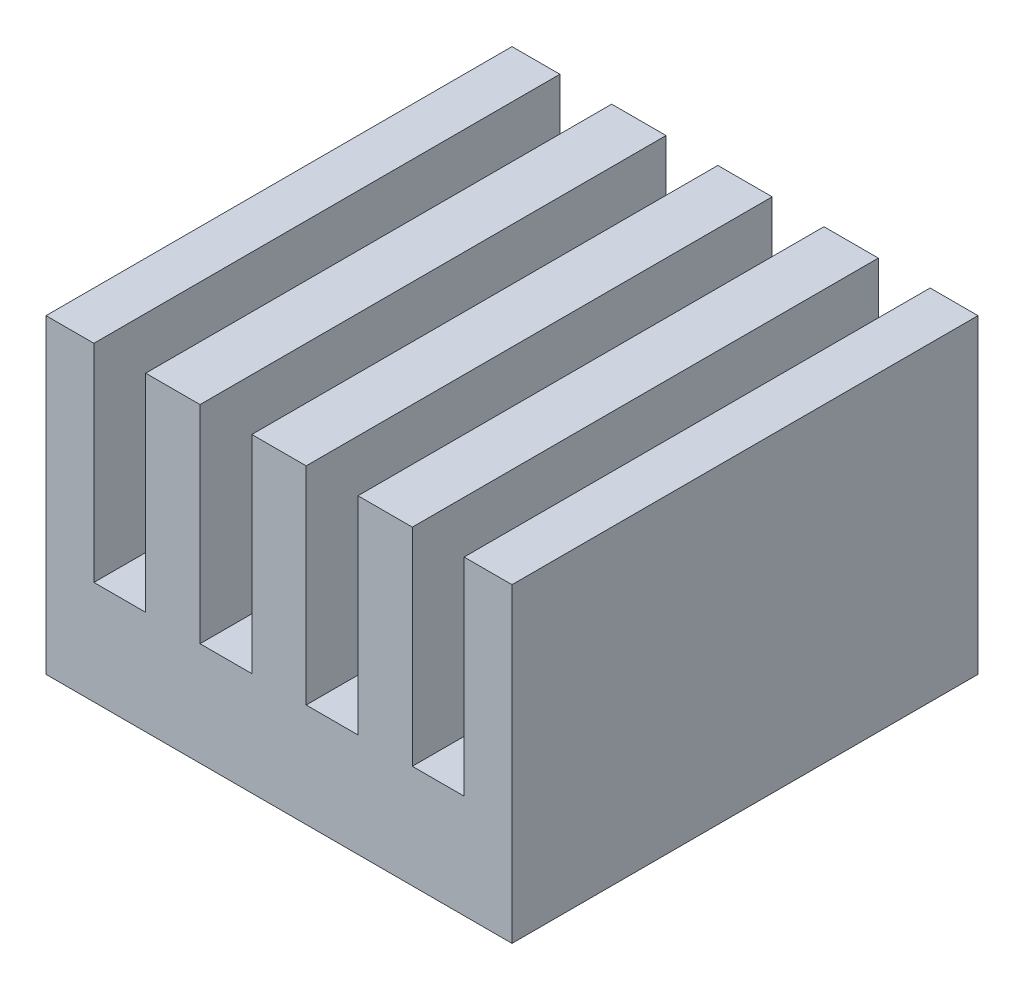
ISO-10303-21;
HEADER;
FILE_DESCRIPTION(('STEP AP214'),'2;1');
FILE_NAME('part.step','',(''),(''),'','','');
FILE_SCHEMA(('AUTOMOTIVE_DESIGN { 1 0 10303 214 1 1 1 1 }'));
ENDSEC;
DATA;
#1=APPLICATION_CONTEXT('core data for automotive mechanical design processes');
#2=APPLICATION_PROTOCOL_DEFINITION('international standard','automotive_design',2000,#1);
#3=PRODUCT_CONTEXT('',#1,'mechanical');
#4=PRODUCT('Part','Part','',(#3));
#5=PRODUCT_RELATED_PRODUCT_CATEGORY('part','',(#4));
#6=PRODUCT_DEFINITION_FORMATION('','',#4);
#7=PRODUCT_DEFINITION_CONTEXT('part definition',#1,'design');
#8=PRODUCT_DEFINITION('design','',#6,#7);
#9=PRODUCT_DEFINITION_SHAPE('','',#8);
#10=(LENGTH_UNIT() NAMED_UNIT(*) SI_UNIT(.MILLI.,.METRE.));
#11=(NAMED_UNIT(*) PLANE_ANGLE_UNIT() SI_UNIT($,.RADIAN.));
#12=(NAMED_UNIT(*) SI_UNIT($,.STERADIAN.) SOLID_ANGLE_UNIT());
#13=UNCERTAINTY_MEASURE_WITH_UNIT(LENGTH_MEASURE(1.E-05),#10,'distance_accuracy_value','');
#14=(GEOMETRIC_REPRESENTATION_CONTEXT(3) GLOBAL_UNCERTAINTY_ASSIGNED_CONTEXT((#13)) GLOBAL_UNIT_ASSIGNED_CONTEXT((#10,
#11,#12)) REPRESENTATION_CONTEXT('',''));
#15=CARTESIAN_POINT('',(0.,0.,0.));
#16=DIRECTION('',(0.,0.,1.));
#17=DIRECTION('',(1.,0.,0.));
#18=AXIS2_PLACEMENT_3D('',#15,#16,#17);
#19=CARTESIAN_POINT('',(-3.575,0.,9.));
#20=DIRECTION('',(1.,0.,0.));
#21=DIRECTION('',(0.,0.,-1.));
#22=AXIS2_PLACEMENT_3D('',#19,#20,#21);
#23=PLANE('',#22);
#24=DIRECTION('',(0.,-1.,0.));
#25=VECTOR('',#24,1.);
#26=CARTESIAN_POINT('',(-3.575,0.,0.));
#27=LINE('',#26,#25);
#28=CARTESIAN_POINT('',(-3.575,6.,0.));
#29=VERTEX_POINT('',#28);
#30=CARTESIAN_POINT('',(-3.575,2.,0.));
#31=VERTEX_POINT('',#30);
#32=EDGE_CURVE('E227',#29,#31,#27,.T.);
#33=ORIENTED_EDGE('',*,*,#32,.F.);
#34=DIRECTION('',(0.,0.,-1.));
#35=VECTOR('',#34,1.);
#36=CARTESIAN_POINT('',(-3.575,6.,9.));
#37=LINE('',#36,#35);
#38=CARTESIAN_POINT('',(-3.575,6.,9.));
#39=VERTEX_POINT('',#38);
#40=EDGE_CURVE('E11',#39,#29,#37,.T.);
#41=ORIENTED_EDGE('',*,*,#40,.F.);
#42=DIRECTION('',(0.,-1.,0.));
#43=VECTOR('',#42,1.);
#44=CARTESIAN_POINT('',(-3.575,0.,9.));
#45=LINE('',#44,#43);
#46=CARTESIAN_POINT('',(-3.575,2.,9.));
#47=VERTEX_POINT('',#46);
#48=EDGE_CURVE('E189',#39,#47,#45,.T.);
#49=ORIENTED_EDGE('',*,*,#48,.T.);
#50=DIRECTION('',(0.,0.,-1.));
#51=VECTOR('',#50,1.);
#52=CARTESIAN_POINT('',(-3.575,2.,9.));
#53=LINE('',#52,#51);
#54=EDGE_CURVE('E103',#47,#31,#53,.T.);
#55=ORIENTED_EDGE('',*,*,#54,.T.);
#56=EDGE_LOOP('',(#33,#41,#49,#55));
#57=FACE_BOUND('',#56,.T.);
#58=ADVANCED_FACE('F16',(#57),#23,.T.);
#59=CARTESIAN_POINT('',(0.,6.,9.));
#60=DIRECTION('',(0.,1.,0.));
#61=DIRECTION('',(-1.,0.,0.));
#62=AXIS2_PLACEMENT_3D('',#59,#60,#61);
#63=PLANE('',#62);
#64=DIRECTION('',(1.,0.,0.));
#65=VECTOR('',#64,1.);
#66=CARTESIAN_POINT('',(0.,6.,0.));
#67=LINE('',#66,#65);
#68=CARTESIAN_POINT('',(-4.5,6.,0.));
#69=VERTEX_POINT('',#68);
#70=EDGE_CURVE('E230',#69,#29,#67,.T.);
#71=ORIENTED_EDGE('',*,*,#70,.F.);
#72=DIRECTION('',(0.,0.,-1.));
#73=VECTOR('',#72,1.);
#74=CARTESIAN_POINT('',(-4.5,6.,9.));
#75=LINE('',#74,#73);
#76=CARTESIAN_POINT('',(-4.5,6.,9.));
#77=VERTEX_POINT('',#76);
#78=EDGE_CURVE('E25',#77,#69,#75,.T.);
#79=ORIENTED_EDGE('',*,*,#78,.F.);
#80=DIRECTION('',(1.,0.,0.));
#81=VECTOR('',#80,1.);
#82=CARTESIAN_POINT('',(0.,6.,9.));
#83=LINE('',#82,#81);
#84=EDGE_CURVE('E178',#77,#39,#83,.T.);
#85=ORIENTED_EDGE('',*,*,#84,.T.);
#86=ORIENTED_EDGE('',*,*,#40,.T.);
#87=EDGE_LOOP('',(#71,#79,#85,#86));
#88=FACE_BOUND('',#87,.T.);
#89=ADVANCED_FACE('F317',(#88),#63,.T.);
#90=CARTESIAN_POINT('',(-4.5,0.,9.));
#91=DIRECTION('',(1.,0.,0.));
#92=DIRECTION('',(0.,1.,0.));
#93=AXIS2_PLACEMENT_3D('',#90,#91,#92);
#94=PLANE('',#93);
#95=DIRECTION('',(0.,-1.,0.));
#96=VECTOR('',#95,1.);
#97=CARTESIAN_POINT('',(-4.5,0.,0.));
#98=LINE('',#97,#96);
#99=CARTESIAN_POINT('',(-4.5,0.,0.));
#100=VERTEX_POINT('',#99);
#101=EDGE_CURVE('E233',#69,#100,#98,.T.);
#102=ORIENTED_EDGE('',*,*,#101,.T.);
#103=DIRECTION('',(0.,0.,-1.));
#104=VECTOR('',#103,1.);
#105=CARTESIAN_POINT('',(-4.5,0.,9.));
#106=LINE('',#105,#104);
#107=CARTESIAN_POINT('',(-4.5,0.,9.));
#108=VERTEX_POINT('',#107);
#109=EDGE_CURVE('E306',#108,#100,#106,.T.);
#110=ORIENTED_EDGE('',*,*,#109,.F.);
#111=DIRECTION('',(0.,-1.,0.));
#112=VECTOR('',#111,1.);
#113=CARTESIAN_POINT('',(-4.5,0.,9.));
#114=LINE('',#113,#112);
#115=EDGE_CURVE('E188',#77,#108,#114,.T.);
#116=ORIENTED_EDGE('',*,*,#115,.F.);
#117=ORIENTED_EDGE('',*,*,#78,.T.);
#118=EDGE_LOOP('',(#102,#110,#116,#117));
#119=FACE_BOUND('',#118,.T.);
#120=ADVANCED_FACE('F311',(#119),#94,.F.);
#121=CARTESIAN_POINT('',(0.,0.,9.));
#122=DIRECTION('',(0.,1.,0.));
#123=DIRECTION('',(0.,0.,1.));
#124=AXIS2_PLACEMENT_3D('',#121,#122,#123);
#125=PLANE('',#124);
#126=DIRECTION('',(1.,0.,0.));
#127=VECTOR('',#126,1.);
#128=CARTESIAN_POINT('',(0.,0.,0.));
#129=LINE('',#128,#127);
#130=CARTESIAN_POINT('',(4.5,0.,0.));
#131=VERTEX_POINT('',#130);
#132=EDGE_CURVE('E236',#100,#131,#129,.T.);
#133=ORIENTED_EDGE('',*,*,#132,.T.);
#134=DIRECTION('',(0.,0.,-1.));
#135=VECTOR('',#134,1.);
#136=CARTESIAN_POINT('',(4.5,0.,9.));
#137=LINE('',#136,#135);
#138=CARTESIAN_POINT('',(4.5,0.,9.));
#139=VERTEX_POINT('',#138);
#140=EDGE_CURVE('E304',#139,#131,#137,.T.);
#141=ORIENTED_EDGE('',*,*,#140,.F.);
#142=DIRECTION('',(1.,0.,0.));
#143=VECTOR('',#142,1.);
#144=CARTESIAN_POINT('',(0.,0.,9.));
#145=LINE('',#144,#143);
#146=EDGE_CURVE('E193',#108,#139,#145,.T.);
#147=ORIENTED_EDGE('',*,*,#146,.F.);
#148=ORIENTED_EDGE('',*,*,#109,.T.);
#149=EDGE_LOOP('',(#133,#141,#147,#148));
#150=FACE_BOUND('',#149,.T.);
#151=ADVANCED_FACE('F325',(#150),#125,.F.);
#152=CARTESIAN_POINT('',(4.5,0.,9.));
#153=DIRECTION('',(1.,0.,0.));
#154=DIRECTION('',(0.,1.,0.));
#155=AXIS2_PLACEMENT_3D('',#152,#153,#154);
#156=PLANE('',#155);
#157=DIRECTION('',(0.,-1.,0.));
#158=VECTOR('',#157,1.);
#159=CARTESIAN_POINT('',(4.5,0.,0.));
#160=LINE('',#159,#158);
#161=CARTESIAN_POINT('',(4.5,6.,0.));
#162=VERTEX_POINT('',#161);
#163=EDGE_CURVE('E239',#162,#131,#160,.T.);
#164=ORIENTED_EDGE('',*,*,#163,.F.);
#165=DIRECTION('',(0.,0.,-1.));
#166=VECTOR('',#165,1.);
#167=CARTESIAN_POINT('',(4.5,6.,9.));
#168=LINE('',#167,#166);
#169=CARTESIAN_POINT('',(4.5,6.,9.));
#170=VERTEX_POINT('',#169);
#171=EDGE_CURVE('E302',#170,#162,#168,.T.);
#172=ORIENTED_EDGE('',*,*,#171,.F.);
#173=DIRECTION('',(0.,-1.,0.));
#174=VECTOR('',#173,1.);
#175=CARTESIAN_POINT('',(4.5,0.,9.));
#176=LINE('',#175,#174);
#177=EDGE_CURVE('E197',#170,#139,#176,.T.);
#178=ORIENTED_EDGE('',*,*,#177,.T.);
#179=ORIENTED_EDGE('',*,*,#140,.T.);
#180=EDGE_LOOP('',(#164,#172,#178,#179));
#181=FACE_BOUND('',#180,.T.);
#182=ADVANCED_FACE('F351',(#181),#156,.T.);
#183=CARTESIAN_POINT('',(3.575,6.,0.));
#184=VERTEX_POINT('',#183);
#185=EDGE_CURVE('E234',#184,#162,#67,.T.);
#186=ORIENTED_EDGE('',*,*,#185,.F.);
#187=DIRECTION('',(0.,0.,-1.));
#188=VECTOR('',#187,1.);
#189=CARTESIAN_POINT('',(3.575,6.,9.));
#190=LINE('',#189,#188);
#191=CARTESIAN_POINT('',(3.575,6.,9.));
#192=VERTEX_POINT('',#191);
#193=EDGE_CURVE('E300',#192,#184,#190,.T.);
#194=ORIENTED_EDGE('',*,*,#193,.F.);
#195=EDGE_CURVE('E190',#192,#170,#83,.T.);
#196=ORIENTED_EDGE('',*,*,#195,.T.);
#197=ORIENTED_EDGE('',*,*,#171,.T.);
#198=EDGE_LOOP('',(#186,#194,#196,#197));
#199=FACE_BOUND('',#198,.T.);
#200=ADVANCED_FACE('F366',(#199),#63,.T.);
#201=CARTESIAN_POINT('',(3.575,0.,9.));
#202=DIRECTION('',(1.,0.,0.));
#203=DIRECTION('',(0.,0.,-1.));
#204=AXIS2_PLACEMENT_3D('',#201,#202,#203);
#205=PLANE('',#204);
#206=DIRECTION('',(0.,-1.,0.));
#207=VECTOR('',#206,1.);
#208=CARTESIAN_POINT('',(3.575,0.,0.));
#209=LINE('',#208,#207);
#210=CARTESIAN_POINT('',(3.575,2.,0.));
#211=VERTEX_POINT('',#210);
#212=EDGE_CURVE('E243',#184,#211,#209,.T.);
#213=ORIENTED_EDGE('',*,*,#212,.T.);
#214=DIRECTION('',(0.,0.,-1.));
#215=VECTOR('',#214,1.);
#216=CARTESIAN_POINT('',(3.575,2.,9.));
#217=LINE('',#216,#215);
#218=CARTESIAN_POINT('',(3.575,2.,9.));
#219=VERTEX_POINT('',#218);
#220=EDGE_CURVE('E297',#219,#211,#217,.T.);
#221=ORIENTED_EDGE('',*,*,#220,.F.);
#222=DIRECTION('',(0.,-1.,0.));
#223=VECTOR('',#222,1.);
#224=CARTESIAN_POINT('',(3.575,0.,9.));
#225=LINE('',#224,#223);
#226=EDGE_CURVE('E196',#192,#219,#225,.T.);
#227=ORIENTED_EDGE('',*,*,#226,.F.);
#228=ORIENTED_EDGE('',*,*,#193,.T.);
#229=EDGE_LOOP('',(#213,#221,#227,#228));
#230=FACE_BOUND('',#229,.T.);
#231=ADVANCED_FACE('F375',(#230),#205,.F.);
#232=CARTESIAN_POINT('',(0.,2.,9.));
#233=DIRECTION('',(0.,1.,0.));
#234=DIRECTION('',(0.,0.,1.));
#235=AXIS2_PLACEMENT_3D('',#232,#233,#234);
#236=PLANE('',#235);
#237=DIRECTION('',(1.,0.,0.));
#238=VECTOR('',#237,1.);
#239=CARTESIAN_POINT('',(0.,2.,0.));
#240=LINE('',#239,#238);
#241=CARTESIAN_POINT('',(2.575,2.,0.));
#242=VERTEX_POINT('',#241);
#243=EDGE_CURVE('E246',#242,#211,#240,.T.);
#244=ORIENTED_EDGE('',*,*,#243,.F.);
#245=DIRECTION('',(0.,0.,-1.));
#246=VECTOR('',#245,1.);
#247=CARTESIAN_POINT('',(2.575,2.,9.));
#248=LINE('',#247,#246);
#249=CARTESIAN_POINT('',(2.575,2.,9.));
#250=VERTEX_POINT('',#249);
#251=EDGE_CURVE('E295',#250,#242,#248,.T.);
#252=ORIENTED_EDGE('',*,*,#251,.F.);
#253=DIRECTION('',(1.,0.,0.));
#254=VECTOR('',#253,1.);
#255=CARTESIAN_POINT('',(0.,2.,9.));
#256=LINE('',#255,#254);
#257=EDGE_CURVE('E200',#250,#219,#256,.T.);
#258=ORIENTED_EDGE('',*,*,#257,.T.);
#259=ORIENTED_EDGE('',*,*,#220,.T.);
#260=EDGE_LOOP('',(#244,#252,#258,#259));
#261=FACE_BOUND('',#260,.T.);
#262=ADVANCED_FACE('F384',(#261),#236,.T.);
#263=CARTESIAN_POINT('',(2.575,0.,9.));
#264=DIRECTION('',(1.,0.,0.));
#265=DIRECTION('',(0.,0.,-1.));
#266=AXIS2_PLACEMENT_3D('',#263,#264,#265);
#267=PLANE('',#266);
#268=DIRECTION('',(0.,-1.,0.));
#269=VECTOR('',#268,1.);
#270=CARTESIAN_POINT('',(2.575,0.,0.));
#271=LINE('',#270,#269);
#272=CARTESIAN_POINT('',(2.575,6.,0.));
#273=VERTEX_POINT('',#272);
#274=EDGE_CURVE('E249',#273,#242,#271,.T.);
#275=ORIENTED_EDGE('',*,*,#274,.F.);
#276=DIRECTION('',(0.,0.,-1.));
#277=VECTOR('',#276,1.);
#278=CARTESIAN_POINT('',(2.575,6.,9.));
#279=LINE('',#278,#277);
#280=CARTESIAN_POINT('',(2.575,6.,9.));
#281=VERTEX_POINT('',#280);
#282=EDGE_CURVE('E293',#281,#273,#279,.T.);
#283=ORIENTED_EDGE('',*,*,#282,.F.);
#284=DIRECTION('',(0.,-1.,0.));
#285=VECTOR('',#284,1.);
#286=CARTESIAN_POINT('',(2.575,0.,9.));
#287=LINE('',#286,#285);
#288=EDGE_CURVE('E206',#281,#250,#287,.T.);
#289=ORIENTED_EDGE('',*,*,#288,.T.);
#290=ORIENTED_EDGE('',*,*,#251,.T.);
#291=EDGE_LOOP('',(#275,#283,#289,#290));
#292=FACE_BOUND('',#291,.T.);
#293=ADVANCED_FACE('F393',(#292),#267,.T.);
#294=CARTESIAN_POINT('',(1.525,6.,0.));
#295=VERTEX_POINT('',#294);
#296=EDGE_CURVE('E253',#295,#273,#67,.T.);
#297=ORIENTED_EDGE('',*,*,#296,.F.);
#298=DIRECTION('',(0.,0.,-1.));
#299=VECTOR('',#298,1.);
#300=CARTESIAN_POINT('',(1.525,6.,9.));
#301=LINE('',#300,#299);
#302=CARTESIAN_POINT('',(1.525,6.,9.));
#303=VERTEX_POINT('',#302);
#304=EDGE_CURVE('E291',#303,#295,#301,.T.);
#305=ORIENTED_EDGE('',*,*,#304,.F.);
#306=EDGE_CURVE('E186',#303,#281,#83,.T.);
#307=ORIENTED_EDGE('',*,*,#306,.T.);
#308=ORIENTED_EDGE('',*,*,#282,.T.);
#309=EDGE_LOOP('',(#297,#305,#307,#308));
#310=FACE_BOUND('',#309,.T.);
#311=ADVANCED_FACE('F377',(#310),#63,.T.);
#312=CARTESIAN_POINT('',(1.525,0.,9.));
#313=DIRECTION('',(1.,0.,0.));
#314=DIRECTION('',(0.,1.,0.));
#315=AXIS2_PLACEMENT_3D('',#312,#313,#314);
#316=PLANE('',#315);
#317=DIRECTION('',(0.,-1.,0.));
#318=VECTOR('',#317,1.);
#319=CARTESIAN_POINT('',(1.525,0.,0.));
#320=LINE('',#319,#318);
#321=CARTESIAN_POINT('',(1.525,2.,0.));
#322=VERTEX_POINT('',#321);
#323=EDGE_CURVE('E254',#295,#322,#320,.T.);
#324=ORIENTED_EDGE('',*,*,#323,.T.);
#325=DIRECTION('',(0.,0.,-1.));
#326=VECTOR('',#325,1.);
#327=CARTESIAN_POINT('',(1.525,2.,9.));
#328=LINE('',#327,#326);
#329=CARTESIAN_POINT('',(1.525,2.,9.));
#330=VERTEX_POINT('',#329);
#331=EDGE_CURVE('E288',#330,#322,#328,.T.);
#332=ORIENTED_EDGE('',*,*,#331,.F.);
#333=DIRECTION('',(0.,-1.,0.));
#334=VECTOR('',#333,1.);
#335=CARTESIAN_POINT('',(1.525,0.,9.));
#336=LINE('',#335,#334);
#337=EDGE_CURVE('E205',#303,#330,#336,.T.);
#338=ORIENTED_EDGE('',*,*,#337,.F.);
#339=ORIENTED_EDGE('',*,*,#304,.T.);
#340=EDGE_LOOP('',(#324,#332,#338,#339));
#341=FACE_BOUND('',#340,.T.);
#342=ADVANCED_FACE('F409',(#341),#316,.F.);
#343=CARTESIAN_POINT('',(0.,2.,9.));
#344=DIRECTION('',(0.,1.,0.));
#345=DIRECTION('',(0.,0.,1.));
#346=AXIS2_PLACEMENT_3D('',#343,#344,#345);
#347=PLANE('',#346);
#348=DIRECTION('',(1.,0.,0.));
#349=VECTOR('',#348,1.);
#350=CARTESIAN_POINT('',(0.,2.,0.));
#351=LINE('',#350,#349);
#352=CARTESIAN_POINT('',(0.525,2.,0.));
#353=VERTEX_POINT('',#352);
#354=EDGE_CURVE('E257',#353,#322,#351,.T.);
#355=ORIENTED_EDGE('',*,*,#354,.F.);
#356=DIRECTION('',(0.,0.,-1.));
#357=VECTOR('',#356,1.);
#358=CARTESIAN_POINT('',(0.525,2.,9.));
#359=LINE('',#358,#357);
#360=CARTESIAN_POINT('',(0.525,2.,9.));
#361=VERTEX_POINT('',#360);
#362=EDGE_CURVE('E286',#361,#353,#359,.T.);
#363=ORIENTED_EDGE('',*,*,#362,.F.);
#364=DIRECTION('',(1.,0.,0.));
#365=VECTOR('',#364,1.);
#366=CARTESIAN_POINT('',(0.,2.,9.));
#367=LINE('',#366,#365);
#368=EDGE_CURVE('E209',#361,#330,#367,.T.);
#369=ORIENTED_EDGE('',*,*,#368,.T.);
#370=ORIENTED_EDGE('',*,*,#331,.T.);
#371=EDGE_LOOP('',(#355,#363,#369,#370));
#372=FACE_BOUND('',#371,.T.);
#373=ADVANCED_FACE('F417',(#372),#347,.T.);
#374=CARTESIAN_POINT('',(0.525,0.,9.));
#375=DIRECTION('',(1.,0.,0.));
#376=DIRECTION('',(0.,0.,-1.));
#377=AXIS2_PLACEMENT_3D('',#374,#375,#376);
#378=PLANE('',#377);
#379=DIRECTION('',(0.,-1.,0.));
#380=VECTOR('',#379,1.);
#381=CARTESIAN_POINT('',(0.525,0.,0.));
#382=LINE('',#381,#380);
#383=CARTESIAN_POINT('',(0.525,6.,0.));
#384=VERTEX_POINT('',#383);
#385=EDGE_CURVE('E260',#384,#353,#382,.T.);
#386=ORIENTED_EDGE('',*,*,#385,.F.);
#387=DIRECTION('',(0.,0.,-1.));
#388=VECTOR('',#387,1.);
#389=CARTESIAN_POINT('',(0.525,6.,9.));
#390=LINE('',#389,#388);
#391=CARTESIAN_POINT('',(0.525,6.,9.));
#392=VERTEX_POINT('',#391);
#393=EDGE_CURVE('E284',#392,#384,#390,.T.);
#394=ORIENTED_EDGE('',*,*,#393,.F.);
#395=DIRECTION('',(0.,-1.,0.));
#396=VECTOR('',#395,1.);
#397=CARTESIAN_POINT('',(0.525,0.,9.));
#398=LINE('',#397,#396);
#399=EDGE_CURVE('E185',#392,#361,#398,.T.);
#400=ORIENTED_EDGE('',*,*,#399,.T.);
#401=ORIENTED_EDGE('',*,*,#362,.T.);
#402=EDGE_LOOP('',(#386,#394,#400,#401));
#403=FACE_BOUND('',#402,.T.);
#404=ADVANCED_FACE('F426',(#403),#378,.T.);
#405=CARTESIAN_POINT('',(-0.525,6.,0.));
#406=VERTEX_POINT('',#405);
#407=EDGE_CURVE('E263',#406,#384,#67,.T.);
#408=ORIENTED_EDGE('',*,*,#407,.F.);
#409=DIRECTION('',(0.,0.,-1.));
#410=VECTOR('',#409,1.);
#411=CARTESIAN_POINT('',(-0.525,6.,9.));
#412=LINE('',#411,#410);
#413=CARTESIAN_POINT('',(-0.525,6.,9.));
#414=VERTEX_POINT('',#413);
#415=EDGE_CURVE('E282',#414,#406,#412,.T.);
#416=ORIENTED_EDGE('',*,*,#415,.F.);
#417=EDGE_CURVE('E177',#414,#392,#83,.T.);
#418=ORIENTED_EDGE('',*,*,#417,.T.);
#419=ORIENTED_EDGE('',*,*,#393,.T.);
#420=EDGE_LOOP('',(#408,#416,#418,#419));
#421=FACE_BOUND('',#420,.T.);
#422=ADVANCED_FACE('F410',(#421),#63,.T.);
#423=CARTESIAN_POINT('',(-0.525,0.,9.));
#424=DIRECTION('',(1.,0.,0.));
#425=DIRECTION('',(0.,0.,-1.));
#426=AXIS2_PLACEMENT_3D('',#423,#424,#425);
#427=PLANE('',#426);
#428=DIRECTION('',(0.,-1.,0.));
#429=VECTOR('',#428,1.);
#430=CARTESIAN_POINT('',(-0.525,0.,0.));
#431=LINE('',#430,#429);
#432=CARTESIAN_POINT('',(-0.525,2.,0.));
#433=VERTEX_POINT('',#432);
#434=EDGE_CURVE('E264',#406,#433,#431,.T.);
#435=ORIENTED_EDGE('',*,*,#434,.T.);
#436=DIRECTION('',(0.,0.,-1.));
#437=VECTOR('',#436,1.);
#438=CARTESIAN_POINT('',(-0.525,2.,9.));
#439=LINE('',#438,#437);
#440=CARTESIAN_POINT('',(-0.525,2.,9.));
#441=VERTEX_POINT('',#440);
#442=EDGE_CURVE('E279',#441,#433,#439,.T.);
#443=ORIENTED_EDGE('',*,*,#442,.F.);
#444=DIRECTION('',(0.,-1.,0.));
#445=VECTOR('',#444,1.);
#446=CARTESIAN_POINT('',(-0.525,0.,9.));
#447=LINE('',#446,#445);
#448=EDGE_CURVE('E184',#414,#441,#447,.T.);
#449=ORIENTED_EDGE('',*,*,#448,.F.);
#450=ORIENTED_EDGE('',*,*,#415,.T.);
#451=EDGE_LOOP('',(#435,#443,#449,#450));
#452=FACE_BOUND('',#451,.T.);
#453=ADVANCED_FACE('F443',(#452),#427,.F.);
#454=CARTESIAN_POINT('',(0.,2.,9.));
#455=DIRECTION('',(0.,-1.,0.));
#456=DIRECTION('',(1.,0.,0.));
#457=AXIS2_PLACEMENT_3D('',#454,#455,#456);
#458=PLANE('',#457);
#459=DIRECTION('',(-1.,0.,0.));
#460=VECTOR('',#459,1.);
#461=CARTESIAN_POINT('',(0.,2.,0.));
#462=LINE('',#461,#460);
#463=CARTESIAN_POINT('',(-1.525,2.,0.));
#464=VERTEX_POINT('',#463);
#465=EDGE_CURVE('E266',#433,#464,#462,.T.);
#466=ORIENTED_EDGE('',*,*,#465,.T.);
#467=DIRECTION('',(0.,0.,-1.));
#468=VECTOR('',#467,1.);
#469=CARTESIAN_POINT('',(-1.525,2.,9.));
#470=LINE('',#469,#468);
#471=CARTESIAN_POINT('',(-1.525,2.,9.));
#472=VERTEX_POINT('',#471);
#473=EDGE_CURVE('E277',#472,#464,#470,.T.);
#474=ORIENTED_EDGE('',*,*,#473,.F.);
#475=DIRECTION('',(-1.,0.,0.));
#476=VECTOR('',#475,1.);
#477=CARTESIAN_POINT('',(0.,2.,9.));
#478=LINE('',#477,#476);
#479=EDGE_CURVE('E179',#441,#472,#478,.T.);
#480=ORIENTED_EDGE('',*,*,#479,.F.);
#481=ORIENTED_EDGE('',*,*,#442,.T.);
#482=EDGE_LOOP('',(#466,#474,#480,#481));
#483=FACE_BOUND('',#482,.T.);
#484=ADVANCED_FACE('F451',(#483),#458,.F.);
#485=CARTESIAN_POINT('',(-1.525,0.,9.));
#486=DIRECTION('',(1.,0.,0.));
#487=DIRECTION('',(0.,1.,0.));
#488=AXIS2_PLACEMENT_3D('',#485,#486,#487);
#489=PLANE('',#488);
#490=DIRECTION('',(0.,-1.,0.));
#491=VECTOR('',#490,1.);
#492=CARTESIAN_POINT('',(-1.525,0.,0.));
#493=LINE('',#492,#491);
#494=CARTESIAN_POINT('',(-1.525,6.,0.));
#495=VERTEX_POINT('',#494);
#496=EDGE_CURVE('E269',#495,#464,#493,.T.);
#497=ORIENTED_EDGE('',*,*,#496,.F.);
#498=DIRECTION('',(0.,0.,-1.));
#499=VECTOR('',#498,1.);
#500=CARTESIAN_POINT('',(-1.525,6.,9.));
#501=LINE('',#500,#499);
#502=CARTESIAN_POINT('',(-1.525,6.,9.));
#503=VERTEX_POINT('',#502);
#504=EDGE_CURVE('E166',#503,#495,#501,.T.);
#505=ORIENTED_EDGE('',*,*,#504,.F.);
#506=DIRECTION('',(0.,-1.,0.));
#507=VECTOR('',#506,1.);
#508=CARTESIAN_POINT('',(-1.525,0.,9.));
#509=LINE('',#508,#507);
#510=EDGE_CURVE('E175',#503,#472,#509,.T.);
#511=ORIENTED_EDGE('',*,*,#510,.T.);
#512=ORIENTED_EDGE('',*,*,#473,.T.);
#513=EDGE_LOOP('',(#497,#505,#511,#512));
#514=FACE_BOUND('',#513,.T.);
#515=ADVANCED_FACE('F460',(#514),#489,.T.);
#516=CARTESIAN_POINT('',(-2.575,6.,0.));
#517=VERTEX_POINT('',#516);
#518=EDGE_CURVE('E165',#517,#495,#67,.T.);
#519=ORIENTED_EDGE('',*,*,#518,.F.);
#520=DIRECTION('',(0.,0.,-1.));
#521=VECTOR('',#520,1.);
#522=CARTESIAN_POINT('',(-2.575,6.,9.));
#523=LINE('',#522,#521);
#524=CARTESIAN_POINT('',(-2.575,6.,9.));
#525=VERTEX_POINT('',#524);
#526=EDGE_CURVE('E159',#525,#517,#523,.T.);
#527=ORIENTED_EDGE('',*,*,#526,.F.);
#528=EDGE_CURVE('E163',#525,#503,#83,.T.);
#529=ORIENTED_EDGE('',*,*,#528,.T.);
#530=ORIENTED_EDGE('',*,*,#504,.T.);
#531=EDGE_LOOP('',(#519,#527,#529,#530));
#532=FACE_BOUND('',#531,.T.);
#533=ADVANCED_FACE('F161',(#532),#63,.T.);
#534=CARTESIAN_POINT('',(-2.575,0.,9.));
#535=DIRECTION('',(1.,0.,0.));
#536=DIRECTION('',(0.,0.,-1.));
#537=AXIS2_PLACEMENT_3D('',#534,#535,#536);
#538=PLANE('',#537);
#539=DIRECTION('',(0.,-1.,0.));
#540=VECTOR('',#539,1.);
#541=CARTESIAN_POINT('',(-2.575,0.,0.));
#542=LINE('',#541,#540);
#543=CARTESIAN_POINT('',(-2.575,2.,0.));
#544=VERTEX_POINT('',#543);
#545=EDGE_CURVE('E96',#517,#544,#542,.T.);
#546=ORIENTED_EDGE('',*,*,#545,.T.);
#547=DIRECTION('',(0.,0.,-1.));
#548=VECTOR('',#547,1.);
#549=CARTESIAN_POINT('',(-2.575,2.,9.));
#550=LINE('',#549,#548);
#551=CARTESIAN_POINT('',(-2.575,2.,9.));
#552=VERTEX_POINT('',#551);
#553=EDGE_CURVE('E167',#552,#544,#550,.T.);
#554=ORIENTED_EDGE('',*,*,#553,.F.);
#555=DIRECTION('',(0.,-1.,0.));
#556=VECTOR('',#555,1.);
#557=CARTESIAN_POINT('',(-2.575,0.,9.));
#558=LINE('',#557,#556);
#559=EDGE_CURVE('E169',#525,#552,#558,.T.);
#560=ORIENTED_EDGE('',*,*,#559,.F.);
#561=ORIENTED_EDGE('',*,*,#526,.T.);
#562=EDGE_LOOP('',(#546,#554,#560,#561));
#563=FACE_BOUND('',#562,.T.);
#564=ADVANCED_FACE('F170',(#563),#538,.F.);
#565=CARTESIAN_POINT('',(0.,2.,9.));
#566=DIRECTION('',(0.,-1.,0.));
#567=DIRECTION('',(1.,0.,0.));
#568=AXIS2_PLACEMENT_3D('',#565,#566,#567);
#569=PLANE('',#568);
#570=DIRECTION('',(-1.,0.,0.));
#571=VECTOR('',#570,1.);
#572=CARTESIAN_POINT('',(0.,2.,0.));
#573=LINE('',#572,#571);
#574=EDGE_CURVE('E194',#544,#31,#573,.T.);
#575=ORIENTED_EDGE('',*,*,#574,.T.);
#576=ORIENTED_EDGE('',*,*,#54,.F.);
#577=DIRECTION('',(-1.,0.,0.));
#578=VECTOR('',#577,1.);
#579=CARTESIAN_POINT('',(0.,2.,9.));
#580=LINE('',#579,#578);
#581=EDGE_CURVE('E33',#552,#47,#580,.T.);
#582=ORIENTED_EDGE('',*,*,#581,.F.);
#583=ORIENTED_EDGE('',*,*,#553,.T.);
#584=EDGE_LOOP('',(#575,#576,#582,#583));
#585=FACE_BOUND('',#584,.T.);
#586=ADVANCED_FACE('F320',(#585),#569,.F.);
#587=CARTESIAN_POINT('',(0.,0.,9.));
#588=DIRECTION('',(0.,0.,1.));
#589=DIRECTION('',(1.,0.,0.));
#590=AXIS2_PLACEMENT_3D('',#587,#588,#589);
#591=PLANE('',#590);
#592=ORIENTED_EDGE('',*,*,#48,.F.);
#593=ORIENTED_EDGE('',*,*,#84,.F.);
#594=ORIENTED_EDGE('',*,*,#115,.T.);
#595=ORIENTED_EDGE('',*,*,#146,.T.);
#596=ORIENTED_EDGE('',*,*,#177,.F.);
#597=ORIENTED_EDGE('',*,*,#195,.F.);
#598=ORIENTED_EDGE('',*,*,#226,.T.);
#599=ORIENTED_EDGE('',*,*,#257,.F.);
#600=ORIENTED_EDGE('',*,*,#288,.F.);
#601=ORIENTED_EDGE('',*,*,#306,.F.);
#602=ORIENTED_EDGE('',*,*,#337,.T.);
#603=ORIENTED_EDGE('',*,*,#368,.F.);
#604=ORIENTED_EDGE('',*,*,#399,.F.);
#605=ORIENTED_EDGE('',*,*,#417,.F.);
#606=ORIENTED_EDGE('',*,*,#448,.T.);
#607=ORIENTED_EDGE('',*,*,#479,.T.);
#608=ORIENTED_EDGE('',*,*,#510,.F.);
#609=ORIENTED_EDGE('',*,*,#528,.F.);
#610=ORIENTED_EDGE('',*,*,#559,.T.);
#611=ORIENTED_EDGE('',*,*,#581,.T.);
#612=EDGE_LOOP('',(#592,#593,#594,#595,#596,#597,#598,#599,#600,#601,#602,#603,#604,#605,#606,
#607,#608,#609,#610,#611));
#613=FACE_BOUND('',#612,.T.);
#614=ADVANCED_FACE('F173',(#613),#591,.T.);
#615=CARTESIAN_POINT('',(0.,0.,0.));
#616=DIRECTION('',(0.,0.,1.));
#617=DIRECTION('',(1.,0.,0.));
#618=AXIS2_PLACEMENT_3D('',#615,#616,#617);
#619=PLANE('',#618);
#620=ORIENTED_EDGE('',*,*,#32,.T.);
#621=ORIENTED_EDGE('',*,*,#574,.F.);
#622=ORIENTED_EDGE('',*,*,#545,.F.);
#623=ORIENTED_EDGE('',*,*,#518,.T.);
#624=ORIENTED_EDGE('',*,*,#496,.T.);
#625=ORIENTED_EDGE('',*,*,#465,.F.);
#626=ORIENTED_EDGE('',*,*,#434,.F.);
#627=ORIENTED_EDGE('',*,*,#407,.T.);
#628=ORIENTED_EDGE('',*,*,#385,.T.);
#629=ORIENTED_EDGE('',*,*,#354,.T.);
#630=ORIENTED_EDGE('',*,*,#323,.F.);
#631=ORIENTED_EDGE('',*,*,#296,.T.);
#632=ORIENTED_EDGE('',*,*,#274,.T.);
#633=ORIENTED_EDGE('',*,*,#243,.T.);
#634=ORIENTED_EDGE('',*,*,#212,.F.);
#635=ORIENTED_EDGE('',*,*,#185,.T.);
#636=ORIENTED_EDGE('',*,*,#163,.T.);
#637=ORIENTED_EDGE('',*,*,#132,.F.);
#638=ORIENTED_EDGE('',*,*,#101,.F.);
#639=ORIENTED_EDGE('',*,*,#70,.T.);
#640=EDGE_LOOP('',(#620,#621,#622,#623,#624,#625,#626,#627,#628,#629,#630,#631,#632,#633,#634,
#635,#636,#637,#638,#639));
#641=FACE_BOUND('',#640,.T.);
#642=ADVANCED_FACE('F316',(#641),#619,.F.);
#643=CLOSED_SHELL('',(#58,#89,#120,#151,#182,#200,#231,#262,#293,#311,#342,#373,#404,#422,#453,
#484,#515,#533,#564,#586,#614,#642));
#644=MANIFOLD_SOLID_BREP('B1',#643);
#645=ADVANCED_BREP_SHAPE_REPRESENTATION('',(#18,#644),#14);
#646=SHAPE_DEFINITION_REPRESENTATION(#9,#645);
ENDSEC;
END-ISO-10303-21;
